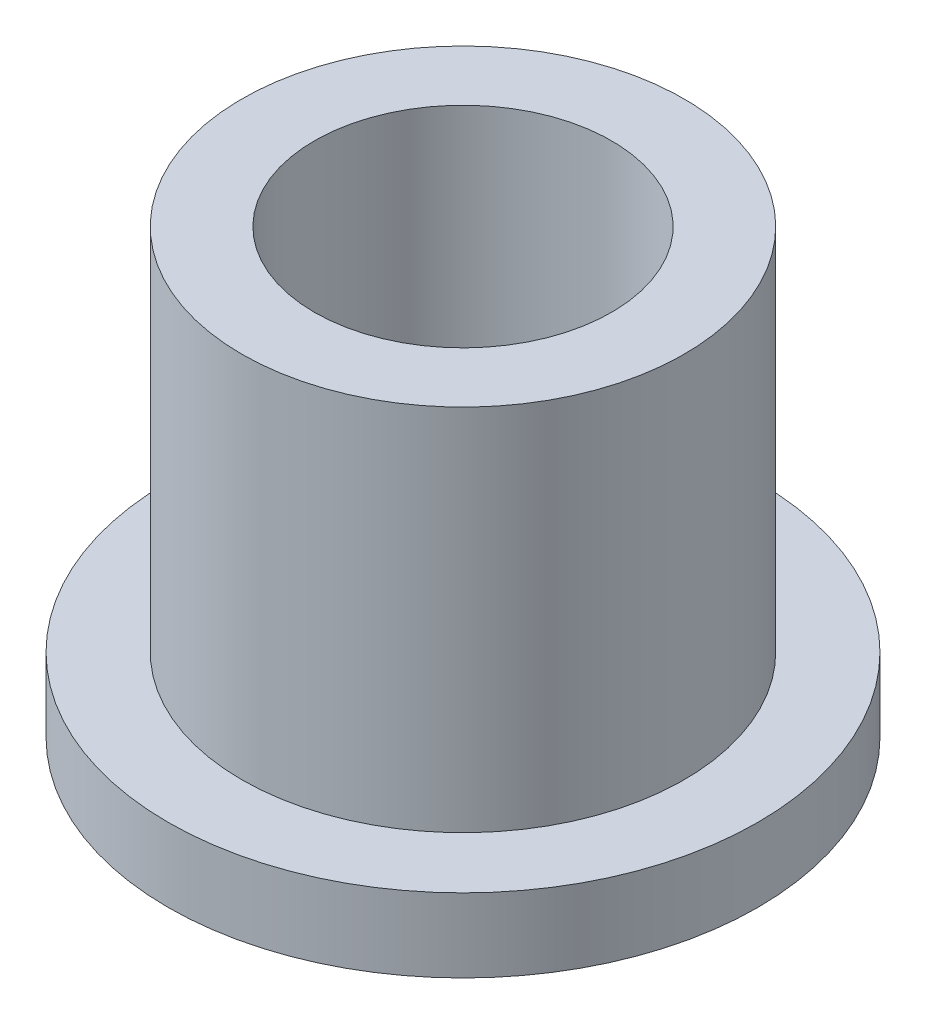
ISO-10303-21;
HEADER;
FILE_DESCRIPTION(('STEP AP214'),'2;1');
FILE_NAME('part.step','',(''),(''),'','','');
FILE_SCHEMA(('AUTOMOTIVE_DESIGN { 1 0 10303 214 1 1 1 1 }'));
ENDSEC;
DATA;
#1=APPLICATION_CONTEXT('core data for automotive mechanical design processes');
#2=APPLICATION_PROTOCOL_DEFINITION('international standard','automotive_design',2000,#1);
#3=PRODUCT_CONTEXT('',#1,'mechanical');
#4=PRODUCT('Part','Part','',(#3));
#5=PRODUCT_RELATED_PRODUCT_CATEGORY('part','',(#4));
#6=PRODUCT_DEFINITION_FORMATION('','',#4);
#7=PRODUCT_DEFINITION_CONTEXT('part definition',#1,'design');
#8=PRODUCT_DEFINITION('design','',#6,#7);
#9=PRODUCT_DEFINITION_SHAPE('','',#8);
#10=(LENGTH_UNIT() NAMED_UNIT(*) SI_UNIT(.MILLI.,.METRE.));
#11=(NAMED_UNIT(*) PLANE_ANGLE_UNIT() SI_UNIT($,.RADIAN.));
#12=(NAMED_UNIT(*) SI_UNIT($,.STERADIAN.) SOLID_ANGLE_UNIT());
#13=UNCERTAINTY_MEASURE_WITH_UNIT(LENGTH_MEASURE(1.E-05),#10,'distance_accuracy_value','');
#14=(GEOMETRIC_REPRESENTATION_CONTEXT(3) GLOBAL_UNCERTAINTY_ASSIGNED_CONTEXT((#13)) GLOBAL_UNIT_ASSIGNED_CONTEXT((#10,
#11,#12)) REPRESENTATION_CONTEXT('',''));
#15=CARTESIAN_POINT('',(0.,0.,0.));
#16=DIRECTION('',(0.,0.,1.));
#17=DIRECTION('',(1.,0.,0.));
#18=AXIS2_PLACEMENT_3D('',#15,#16,#17);
#19=CARTESIAN_POINT('',(0.,19.05,0.));
#20=DIRECTION('',(0.,1.,0.));
#21=DIRECTION('',(0.,0.,1.));
#22=AXIS2_PLACEMENT_3D('',#19,#20,#21);
#23=PLANE('',#22);
#24=CARTESIAN_POINT('',(0.,19.05,0.));
#25=DIRECTION('',(0.,1.,0.));
#26=DIRECTION('',(0.,0.,1.));
#27=AXIS2_PLACEMENT_3D('',#24,#25,#26);
#28=CIRCLE('',#27,9.525);
#29=CARTESIAN_POINT('',(0.,19.05,9.525));
#30=VERTEX_POINT('',#29);
#31=EDGE_CURVE('E10',#30,#30,#28,.T.);
#32=ORIENTED_EDGE('',*,*,#31,.T.);
#33=EDGE_LOOP('',(#32));
#34=FACE_BOUND('',#33,.T.);
#35=CARTESIAN_POINT('',(0.,19.05,0.));
#36=DIRECTION('',(0.,1.,0.));
#37=DIRECTION('',(0.,0.,1.));
#38=AXIS2_PLACEMENT_3D('',#35,#36,#37);
#39=CIRCLE('',#38,6.4008);
#40=CARTESIAN_POINT('',(0.,19.05,6.4008));
#41=VERTEX_POINT('',#40);
#42=EDGE_CURVE('E38',#41,#41,#39,.T.);
#43=ORIENTED_EDGE('',*,*,#42,.F.);
#44=EDGE_LOOP('',(#43));
#45=FACE_BOUND('',#44,.T.);
#46=ADVANCED_FACE('F31',(#34,#45),#23,.T.);
#47=CARTESIAN_POINT('',(0.,0.,0.));
#48=DIRECTION('',(0.,1.,0.));
#49=DIRECTION('',(0.,0.,1.));
#50=AXIS2_PLACEMENT_3D('',#47,#48,#49);
#51=PLANE('',#50);
#52=CARTESIAN_POINT('',(0.,0.,0.));
#53=DIRECTION('',(0.,1.,0.));
#54=DIRECTION('',(0.,0.,1.));
#55=AXIS2_PLACEMENT_3D('',#52,#53,#54);
#56=CIRCLE('',#55,6.4008);
#57=CARTESIAN_POINT('',(0.,0.,6.4008));
#58=VERTEX_POINT('',#57);
#59=EDGE_CURVE('E42',#58,#58,#56,.T.);
#60=ORIENTED_EDGE('',*,*,#59,.T.);
#61=EDGE_LOOP('',(#60));
#62=FACE_BOUND('',#61,.T.);
#63=CARTESIAN_POINT('',(0.,0.,0.));
#64=DIRECTION('',(0.,1.,0.));
#65=DIRECTION('',(0.,0.,1.));
#66=AXIS2_PLACEMENT_3D('',#63,#64,#65);
#67=CIRCLE('',#66,12.7);
#68=CARTESIAN_POINT('',(0.,0.,12.7));
#69=VERTEX_POINT('',#68);
#70=EDGE_CURVE('E49',#69,#69,#67,.T.);
#71=ORIENTED_EDGE('',*,*,#70,.F.);
#72=EDGE_LOOP('',(#71));
#73=FACE_BOUND('',#72,.T.);
#74=ADVANCED_FACE('F74',(#62,#73),#51,.F.);
#75=CARTESIAN_POINT('',(0.,19.05,0.));
#76=DIRECTION('',(0.,-1.,0.));
#77=DIRECTION('',(0.,0.,-1.));
#78=AXIS2_PLACEMENT_3D('',#75,#76,#77);
#79=CYLINDRICAL_SURFACE('',#78,9.525);
#80=CARTESIAN_POINT('',(0.,3.175,0.));
#81=DIRECTION('',(0.,1.,0.));
#82=DIRECTION('',(0.,0.,1.));
#83=AXIS2_PLACEMENT_3D('',#80,#81,#82);
#84=CIRCLE('',#83,9.525);
#85=CARTESIAN_POINT('',(0.,3.175,9.525));
#86=VERTEX_POINT('',#85);
#87=EDGE_CURVE('E52',#86,#86,#84,.T.);
#88=ORIENTED_EDGE('',*,*,#87,.T.);
#89=EDGE_LOOP('',(#88));
#90=FACE_BOUND('',#89,.T.);
#91=ORIENTED_EDGE('',*,*,#31,.F.);
#92=EDGE_LOOP('',(#91));
#93=FACE_BOUND('',#92,.T.);
#94=ADVANCED_FACE('F33',(#90,#93),#79,.T.);
#95=CARTESIAN_POINT('',(0.,19.05,0.));
#96=DIRECTION('',(0.,-1.,0.));
#97=DIRECTION('',(0.,0.,-1.));
#98=AXIS2_PLACEMENT_3D('',#95,#96,#97);
#99=CYLINDRICAL_SURFACE('',#98,6.4008);
#100=ORIENTED_EDGE('',*,*,#42,.T.);
#101=EDGE_LOOP('',(#100));
#102=FACE_BOUND('',#101,.T.);
#103=ORIENTED_EDGE('',*,*,#59,.F.);
#104=EDGE_LOOP('',(#103));
#105=FACE_BOUND('',#104,.T.);
#106=ADVANCED_FACE('F63',(#102,#105),#99,.F.);
#107=CARTESIAN_POINT('',(0.,3.175,0.));
#108=DIRECTION('',(0.,1.,0.));
#109=DIRECTION('',(0.,0.,1.));
#110=AXIS2_PLACEMENT_3D('',#107,#108,#109);
#111=PLANE('',#110);
#112=CARTESIAN_POINT('',(0.,3.175,0.));
#113=DIRECTION('',(0.,1.,0.));
#114=DIRECTION('',(0.,0.,1.));
#115=AXIS2_PLACEMENT_3D('',#112,#113,#114);
#116=CIRCLE('',#115,12.7);
#117=CARTESIAN_POINT('',(0.,3.175,12.7));
#118=VERTEX_POINT('',#117);
#119=EDGE_CURVE('E47',#118,#118,#116,.T.);
#120=ORIENTED_EDGE('',*,*,#119,.T.);
#121=EDGE_LOOP('',(#120));
#122=FACE_BOUND('',#121,.T.);
#123=ORIENTED_EDGE('',*,*,#87,.F.);
#124=EDGE_LOOP('',(#123));
#125=FACE_BOUND('',#124,.T.);
#126=ADVANCED_FACE('F60',(#122,#125),#111,.T.);
#127=CARTESIAN_POINT('',(0.,3.175,0.));
#128=DIRECTION('',(0.,-1.,0.));
#129=DIRECTION('',(0.,0.,-1.));
#130=AXIS2_PLACEMENT_3D('',#127,#128,#129);
#131=CYLINDRICAL_SURFACE('',#130,12.7);
#132=ORIENTED_EDGE('',*,*,#119,.F.);
#133=EDGE_LOOP('',(#132));
#134=FACE_BOUND('',#133,.T.);
#135=ORIENTED_EDGE('',*,*,#70,.T.);
#136=EDGE_LOOP('',(#135));
#137=FACE_BOUND('',#136,.T.);
#138=ADVANCED_FACE('F62',(#134,#137),#131,.T.);
#139=CLOSED_SHELL('',(#46,#74,#94,#106,#126,#138));
#140=MANIFOLD_SOLID_BREP('B2',#139);
#141=ADVANCED_BREP_SHAPE_REPRESENTATION('',(#18,#140),#14);
#142=SHAPE_DEFINITION_REPRESENTATION(#9,#141);
ENDSEC;
END-ISO-10303-21;
